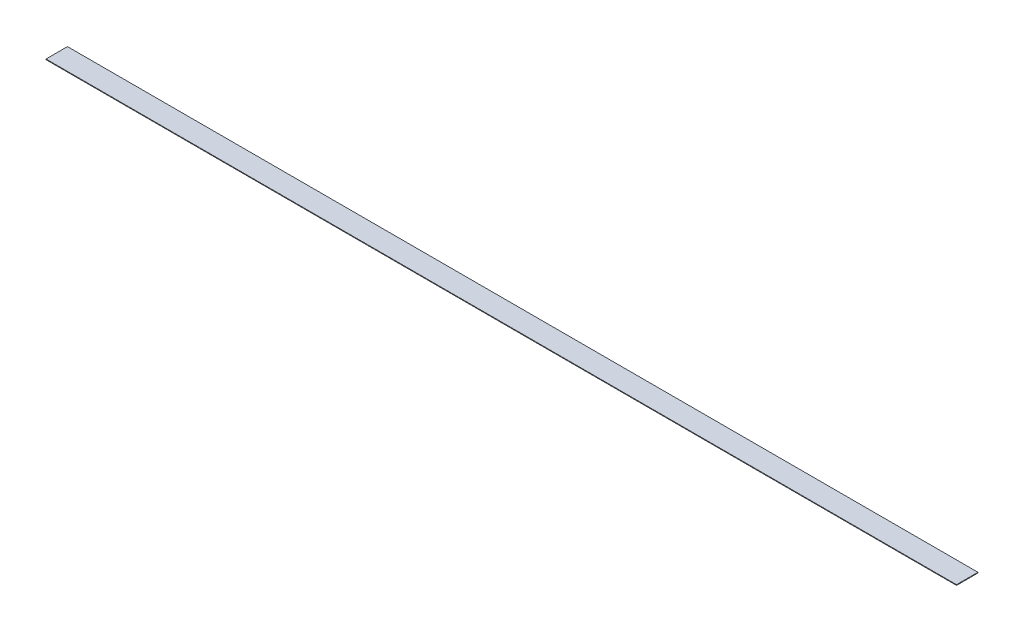
ISO-10303-21;
HEADER;
FILE_DESCRIPTION(('STEP AP214'),'2;1');
FILE_NAME('part.step','',(''),(''),'','','');
FILE_SCHEMA(('AUTOMOTIVE_DESIGN { 1 0 10303 214 1 1 1 1 }'));
ENDSEC;
DATA;
#1=APPLICATION_CONTEXT('core data for automotive mechanical design processes');
#2=APPLICATION_PROTOCOL_DEFINITION('international standard','automotive_design',2000,#1);
#3=PRODUCT_CONTEXT('',#1,'mechanical');
#4=PRODUCT('Part','Part','',(#3));
#5=PRODUCT_RELATED_PRODUCT_CATEGORY('part','',(#4));
#6=PRODUCT_DEFINITION_FORMATION('','',#4);
#7=PRODUCT_DEFINITION_CONTEXT('part definition',#1,'design');
#8=PRODUCT_DEFINITION('design','',#6,#7);
#9=PRODUCT_DEFINITION_SHAPE('','',#8);
#10=(LENGTH_UNIT() NAMED_UNIT(*) SI_UNIT(.MILLI.,.METRE.));
#11=(NAMED_UNIT(*) PLANE_ANGLE_UNIT() SI_UNIT($,.RADIAN.));
#12=(NAMED_UNIT(*) SI_UNIT($,.STERADIAN.) SOLID_ANGLE_UNIT());
#13=UNCERTAINTY_MEASURE_WITH_UNIT(LENGTH_MEASURE(1.E-05),#10,'distance_accuracy_value','');
#14=(GEOMETRIC_REPRESENTATION_CONTEXT(3) GLOBAL_UNCERTAINTY_ASSIGNED_CONTEXT((#13)) GLOBAL_UNIT_ASSIGNED_CONTEXT((#10,
#11,#12)) REPRESENTATION_CONTEXT('',''));
#15=CARTESIAN_POINT('',(0.,0.,0.));
#16=DIRECTION('',(0.,0.,1.));
#17=DIRECTION('',(1.,0.,0.));
#18=AXIS2_PLACEMENT_3D('',#15,#16,#17);
#19=CARTESIAN_POINT('',(-336.549999999998,0.457199999999991,-7.93749999999999));
#20=DIRECTION('',(1.,0.,0.));
#21=DIRECTION('',(0.,0.,-1.));
#22=AXIS2_PLACEMENT_3D('',#19,#20,#21);
#23=PLANE('',#22);
#24=DIRECTION('',(0.,0.,1.));
#25=VECTOR('',#24,1.);
#26=CARTESIAN_POINT('',(-336.549999999998,1.66533453693773E-13,-7.93749999999999));
#27=LINE('',#26,#25);
#28=CARTESIAN_POINT('',(-336.549999999998,1.66533453693773E-13,-7.93749999999999));
#29=VERTEX_POINT('',#28);
#30=CARTESIAN_POINT('',(-336.549999999998,0.,7.93749999999999));
#31=VERTEX_POINT('',#30);
#32=EDGE_CURVE('E105',#29,#31,#27,.T.);
#33=ORIENTED_EDGE('',*,*,#32,.T.);
#34=DIRECTION('',(0.,-1.,0.));
#35=VECTOR('',#34,1.);
#36=CARTESIAN_POINT('',(-336.549999999998,0.457200000000157,7.93749999999999));
#37=LINE('',#36,#35);
#38=CARTESIAN_POINT('',(-336.549999999998,0.457200000000157,7.93749999999999));
#39=VERTEX_POINT('',#38);
#40=EDGE_CURVE('E11',#39,#31,#37,.T.);
#41=ORIENTED_EDGE('',*,*,#40,.F.);
#42=DIRECTION('',(0.,0.,1.));
#43=VECTOR('',#42,1.);
#44=CARTESIAN_POINT('',(-336.549999999998,0.457199999999991,-7.93749999999999));
#45=LINE('',#44,#43);
#46=CARTESIAN_POINT('',(-336.549999999998,0.457199999999991,-7.93749999999999));
#47=VERTEX_POINT('',#46);
#48=EDGE_CURVE('E88',#47,#39,#45,.T.);
#49=ORIENTED_EDGE('',*,*,#48,.F.);
#50=DIRECTION('',(0.,-1.,0.));
#51=VECTOR('',#50,1.);
#52=CARTESIAN_POINT('',(-336.549999999998,0.457199999999991,-7.93749999999999));
#53=LINE('',#52,#51);
#54=EDGE_CURVE('E101',#47,#29,#53,.T.);
#55=ORIENTED_EDGE('',*,*,#54,.T.);
#56=EDGE_LOOP('',(#33,#41,#49,#55));
#57=FACE_BOUND('',#56,.T.);
#58=ADVANCED_FACE('F36',(#57),#23,.F.);
#59=CARTESIAN_POINT('',(336.550000000002,0.457199999999991,7.93749999999988));
#60=DIRECTION('',(0.,0.,-1.));
#61=DIRECTION('',(-1.,0.,0.));
#62=AXIS2_PLACEMENT_3D('',#59,#60,#61);
#63=PLANE('',#62);
#64=DIRECTION('',(1.,0.,0.));
#65=VECTOR('',#64,1.);
#66=CARTESIAN_POINT('',(336.550000000002,-1.66533453693773E-13,7.93749999999988));
#67=LINE('',#66,#65);
#68=CARTESIAN_POINT('',(336.550000000002,-1.66533453693773E-13,7.93749999999988));
#69=VERTEX_POINT('',#68);
#70=EDGE_CURVE('E93',#31,#69,#67,.T.);
#71=ORIENTED_EDGE('',*,*,#70,.T.);
#72=DIRECTION('',(0.,-1.,0.));
#73=VECTOR('',#72,1.);
#74=CARTESIAN_POINT('',(336.550000000002,0.457199999999991,7.93749999999988));
#75=LINE('',#74,#73);
#76=CARTESIAN_POINT('',(336.550000000002,0.457199999999991,7.93749999999988));
#77=VERTEX_POINT('',#76);
#78=EDGE_CURVE('E45',#77,#69,#75,.T.);
#79=ORIENTED_EDGE('',*,*,#78,.F.);
#80=DIRECTION('',(1.,0.,0.));
#81=VECTOR('',#80,1.);
#82=CARTESIAN_POINT('',(336.550000000002,0.457199999999991,7.93749999999988));
#83=LINE('',#82,#81);
#84=EDGE_CURVE('E83',#39,#77,#83,.T.);
#85=ORIENTED_EDGE('',*,*,#84,.F.);
#86=ORIENTED_EDGE('',*,*,#40,.T.);
#87=EDGE_LOOP('',(#71,#79,#85,#86));
#88=FACE_BOUND('',#87,.T.);
#89=ADVANCED_FACE('F92',(#88),#63,.F.);
#90=CARTESIAN_POINT('',(336.550000000002,0.457199999999991,-7.9375000000001));
#91=DIRECTION('',(-1.,0.,0.));
#92=DIRECTION('',(0.,0.,1.));
#93=AXIS2_PLACEMENT_3D('',#90,#91,#92);
#94=PLANE('',#93);
#95=DIRECTION('',(0.,0.,-1.));
#96=VECTOR('',#95,1.);
#97=CARTESIAN_POINT('',(336.550000000002,0.,-7.9375000000001));
#98=LINE('',#97,#96);
#99=CARTESIAN_POINT('',(336.550000000002,0.,-7.9375000000001));
#100=VERTEX_POINT('',#99);
#101=EDGE_CURVE('E70',#69,#100,#98,.T.);
#102=ORIENTED_EDGE('',*,*,#101,.T.);
#103=DIRECTION('',(0.,-1.,0.));
#104=VECTOR('',#103,1.);
#105=CARTESIAN_POINT('',(336.550000000002,0.457199999999991,-7.9375000000001));
#106=LINE('',#105,#104);
#107=CARTESIAN_POINT('',(336.550000000002,0.457199999999991,-7.9375000000001));
#108=VERTEX_POINT('',#107);
#109=EDGE_CURVE('E95',#108,#100,#106,.T.);
#110=ORIENTED_EDGE('',*,*,#109,.F.);
#111=DIRECTION('',(0.,0.,-1.));
#112=VECTOR('',#111,1.);
#113=CARTESIAN_POINT('',(336.550000000002,0.457199999999991,-7.9375000000001));
#114=LINE('',#113,#112);
#115=EDGE_CURVE('E86',#77,#108,#114,.T.);
#116=ORIENTED_EDGE('',*,*,#115,.F.);
#117=ORIENTED_EDGE('',*,*,#78,.T.);
#118=EDGE_LOOP('',(#102,#110,#116,#117));
#119=FACE_BOUND('',#118,.T.);
#120=ADVANCED_FACE('F96',(#119),#94,.F.);
#121=CARTESIAN_POINT('',(336.550000000002,0.457199999999991,-7.9375000000001));
#122=DIRECTION('',(0.,0.,1.));
#123=DIRECTION('',(1.,0.,0.));
#124=AXIS2_PLACEMENT_3D('',#121,#122,#123);
#125=PLANE('',#124);
#126=DIRECTION('',(-1.,0.,0.));
#127=VECTOR('',#126,1.);
#128=CARTESIAN_POINT('',(336.550000000002,0.,-7.9375000000001));
#129=LINE('',#128,#127);
#130=EDGE_CURVE('E76',#100,#29,#129,.T.);
#131=ORIENTED_EDGE('',*,*,#130,.T.);
#132=ORIENTED_EDGE('',*,*,#54,.F.);
#133=DIRECTION('',(-1.,0.,0.));
#134=VECTOR('',#133,1.);
#135=CARTESIAN_POINT('',(336.550000000002,0.457199999999991,-7.9375000000001));
#136=LINE('',#135,#134);
#137=EDGE_CURVE('E53',#108,#47,#136,.T.);
#138=ORIENTED_EDGE('',*,*,#137,.F.);
#139=ORIENTED_EDGE('',*,*,#109,.T.);
#140=EDGE_LOOP('',(#131,#132,#138,#139));
#141=FACE_BOUND('',#140,.T.);
#142=ADVANCED_FACE('F119',(#141),#125,.F.);
#143=CARTESIAN_POINT('',(0.,0.457200000000157,0.));
#144=DIRECTION('',(0.,-1.,0.));
#145=DIRECTION('',(0.,0.,-1.));
#146=AXIS2_PLACEMENT_3D('',#143,#144,#145);
#147=PLANE('',#146);
#148=ORIENTED_EDGE('',*,*,#48,.T.);
#149=ORIENTED_EDGE('',*,*,#84,.T.);
#150=ORIENTED_EDGE('',*,*,#115,.T.);
#151=ORIENTED_EDGE('',*,*,#137,.T.);
#152=EDGE_LOOP('',(#148,#149,#150,#151));
#153=FACE_BOUND('',#152,.T.);
#154=ADVANCED_FACE('F84',(#153),#147,.F.);
#155=CARTESIAN_POINT('',(0.,0.,0.));
#156=DIRECTION('',(0.,-1.,0.));
#157=DIRECTION('',(0.,0.,-1.));
#158=AXIS2_PLACEMENT_3D('',#155,#156,#157);
#159=PLANE('',#158);
#160=ORIENTED_EDGE('',*,*,#32,.F.);
#161=ORIENTED_EDGE('',*,*,#130,.F.);
#162=ORIENTED_EDGE('',*,*,#101,.F.);
#163=ORIENTED_EDGE('',*,*,#70,.F.);
#164=EDGE_LOOP('',(#160,#161,#162,#163));
#165=FACE_BOUND('',#164,.T.);
#166=ADVANCED_FACE('F122',(#165),#159,.T.);
#167=CLOSED_SHELL('',(#58,#89,#120,#142,#154,#166));
#168=MANIFOLD_SOLID_BREP('B2',#167);
#169=ADVANCED_BREP_SHAPE_REPRESENTATION('',(#18,#168),#14);
#170=SHAPE_DEFINITION_REPRESENTATION(#9,#169);
ENDSEC;
END-ISO-10303-21;
